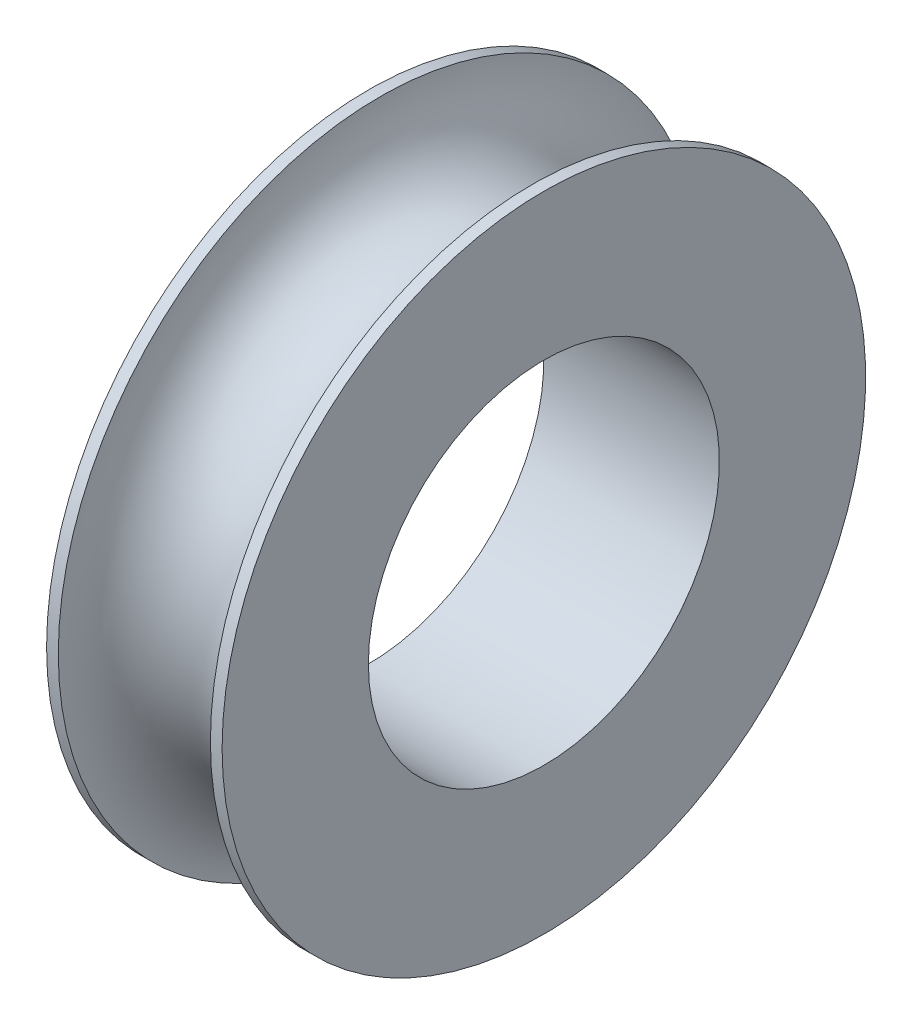
ISO-10303-21;
HEADER;
FILE_DESCRIPTION(('STEP AP214'),'2;1');
FILE_NAME('part.step','',(''),(''),'','','');
FILE_SCHEMA(('AUTOMOTIVE_DESIGN { 1 0 10303 214 1 1 1 1 }'));
ENDSEC;
DATA;
#1=APPLICATION_CONTEXT('core data for automotive mechanical design processes');
#2=APPLICATION_PROTOCOL_DEFINITION('international standard','automotive_design',2000,#1);
#3=PRODUCT_CONTEXT('',#1,'mechanical');
#4=PRODUCT('Part','Part','',(#3));
#5=PRODUCT_RELATED_PRODUCT_CATEGORY('part','',(#4));
#6=PRODUCT_DEFINITION_FORMATION('','',#4);
#7=PRODUCT_DEFINITION_CONTEXT('part definition',#1,'design');
#8=PRODUCT_DEFINITION('design','',#6,#7);
#9=PRODUCT_DEFINITION_SHAPE('','',#8);
#10=(LENGTH_UNIT() NAMED_UNIT(*) SI_UNIT(.MILLI.,.METRE.));
#11=(NAMED_UNIT(*) PLANE_ANGLE_UNIT() SI_UNIT($,.RADIAN.));
#12=(NAMED_UNIT(*) SI_UNIT($,.STERADIAN.) SOLID_ANGLE_UNIT());
#13=UNCERTAINTY_MEASURE_WITH_UNIT(LENGTH_MEASURE(1.E-05),#10,'distance_accuracy_value','');
#14=(GEOMETRIC_REPRESENTATION_CONTEXT(3) GLOBAL_UNCERTAINTY_ASSIGNED_CONTEXT((#13)) GLOBAL_UNIT_ASSIGNED_CONTEXT((#10,
#11,#12)) REPRESENTATION_CONTEXT('',''));
#15=CARTESIAN_POINT('',(0.,0.,0.));
#16=DIRECTION('',(0.,0.,1.));
#17=DIRECTION('',(1.,0.,0.));
#18=AXIS2_PLACEMENT_3D('',#15,#16,#17);
#19=CARTESIAN_POINT('',(-8.53250890397511,0.,0.));
#20=DIRECTION('',(-1.,0.,0.));
#21=DIRECTION('',(0.,0.,1.));
#22=AXIS2_PLACEMENT_3D('',#19,#20,#21);
#23=CYLINDRICAL_SURFACE('',#22,11.);
#24=CARTESIAN_POINT('',(0.,0.,0.));
#25=DIRECTION('',(-1.,0.,0.));
#26=DIRECTION('',(0.,0.,1.));
#27=AXIS2_PLACEMENT_3D('',#24,#25,#26);
#28=CIRCLE('',#27,11.);
#29=CARTESIAN_POINT('',(0.,0.,11.));
#30=VERTEX_POINT('',#29);
#31=EDGE_CURVE('E10',#30,#30,#28,.T.);
#32=ORIENTED_EDGE('',*,*,#31,.F.);
#33=EDGE_LOOP('',(#32));
#34=FACE_BOUND('',#33,.T.);
#35=CARTESIAN_POINT('',(0.400000000000001,0.,0.));
#36=DIRECTION('',(-1.,0.,0.));
#37=DIRECTION('',(0.,0.,1.));
#38=AXIS2_PLACEMENT_3D('',#35,#36,#37);
#39=CIRCLE('',#38,11.);
#40=CARTESIAN_POINT('',(0.400000000000001,0.,11.));
#41=VERTEX_POINT('',#40);
#42=EDGE_CURVE('E58',#41,#41,#39,.T.);
#43=ORIENTED_EDGE('',*,*,#42,.T.);
#44=EDGE_LOOP('',(#43));
#45=FACE_BOUND('',#44,.T.);
#46=ADVANCED_FACE('F36',(#34,#45),#23,.T.);
#47=CARTESIAN_POINT('',(0.,0.,-11.));
#48=DIRECTION('',(1.,0.,0.));
#49=DIRECTION('',(0.,0.,-1.));
#50=AXIS2_PLACEMENT_3D('',#47,#48,#49);
#51=PLANE('',#50);
#52=CARTESIAN_POINT('',(0.,0.,0.));
#53=DIRECTION('',(-1.,0.,0.));
#54=DIRECTION('',(0.,0.,1.));
#55=AXIS2_PLACEMENT_3D('',#52,#53,#54);
#56=CIRCLE('',#55,6.);
#57=CARTESIAN_POINT('',(0.,0.,6.));
#58=VERTEX_POINT('',#57);
#59=EDGE_CURVE('E42',#58,#58,#56,.T.);
#60=ORIENTED_EDGE('',*,*,#59,.F.);
#61=EDGE_LOOP('',(#60));
#62=FACE_BOUND('',#61,.T.);
#63=ORIENTED_EDGE('',*,*,#31,.T.);
#64=EDGE_LOOP('',(#63));
#65=FACE_BOUND('',#64,.T.);
#66=ADVANCED_FACE('F83',(#62,#65),#51,.F.);
#67=CARTESIAN_POINT('',(-8.53250890397511,0.,0.));
#68=DIRECTION('',(-1.,0.,0.));
#69=DIRECTION('',(0.,0.,1.));
#70=AXIS2_PLACEMENT_3D('',#67,#68,#69);
#71=CYLINDRICAL_SURFACE('',#70,6.);
#72=CARTESIAN_POINT('',(6.,0.,0.));
#73=DIRECTION('',(-1.,0.,0.));
#74=DIRECTION('',(0.,0.,1.));
#75=AXIS2_PLACEMENT_3D('',#72,#73,#74);
#76=CIRCLE('',#75,6.);
#77=CARTESIAN_POINT('',(6.,0.,6.));
#78=VERTEX_POINT('',#77);
#79=EDGE_CURVE('E46',#78,#78,#76,.T.);
#80=ORIENTED_EDGE('',*,*,#79,.F.);
#81=EDGE_LOOP('',(#80));
#82=FACE_BOUND('',#81,.T.);
#83=ORIENTED_EDGE('',*,*,#59,.T.);
#84=EDGE_LOOP('',(#83));
#85=FACE_BOUND('',#84,.T.);
#86=ADVANCED_FACE('F78',(#82,#85),#71,.F.);
#87=CARTESIAN_POINT('',(6.,0.,-11.));
#88=DIRECTION('',(-1.,0.,0.));
#89=DIRECTION('',(0.,0.,1.));
#90=AXIS2_PLACEMENT_3D('',#87,#88,#89);
#91=PLANE('',#90);
#92=CARTESIAN_POINT('',(6.,0.,0.));
#93=DIRECTION('',(-1.,0.,0.));
#94=DIRECTION('',(0.,0.,1.));
#95=AXIS2_PLACEMENT_3D('',#92,#93,#94);
#96=CIRCLE('',#95,11.);
#97=CARTESIAN_POINT('',(6.,0.,11.));
#98=VERTEX_POINT('',#97);
#99=EDGE_CURVE('E50',#98,#98,#96,.T.);
#100=ORIENTED_EDGE('',*,*,#99,.F.);
#101=EDGE_LOOP('',(#100));
#102=FACE_BOUND('',#101,.T.);
#103=ORIENTED_EDGE('',*,*,#79,.T.);
#104=EDGE_LOOP('',(#103));
#105=FACE_BOUND('',#104,.T.);
#106=ADVANCED_FACE('F72',(#102,#105),#91,.F.);
#107=CARTESIAN_POINT('',(-8.53250890397511,0.,0.));
#108=DIRECTION('',(-1.,0.,0.));
#109=DIRECTION('',(0.,0.,1.));
#110=AXIS2_PLACEMENT_3D('',#107,#108,#109);
#111=CYLINDRICAL_SURFACE('',#110,11.);
#112=CARTESIAN_POINT('',(5.6,0.,0.));
#113=DIRECTION('',(-1.,0.,0.));
#114=DIRECTION('',(0.,0.,1.));
#115=AXIS2_PLACEMENT_3D('',#112,#113,#114);
#116=CIRCLE('',#115,11.);
#117=CARTESIAN_POINT('',(5.6,0.,11.));
#118=VERTEX_POINT('',#117);
#119=EDGE_CURVE('E55',#118,#118,#116,.T.);
#120=ORIENTED_EDGE('',*,*,#119,.F.);
#121=EDGE_LOOP('',(#120));
#122=FACE_BOUND('',#121,.T.);
#123=ORIENTED_EDGE('',*,*,#99,.T.);
#124=EDGE_LOOP('',(#123));
#125=FACE_BOUND('',#124,.T.);
#126=ADVANCED_FACE('F66',(#122,#125),#111,.T.);
#127=CARTESIAN_POINT('',(3.,0.,0.));
#128=DIRECTION('',(-1.,0.,0.));
#129=DIRECTION('',(0.,0.,1.));
#130=AXIS2_PLACEMENT_3D('',#127,#128,#129);
#131=TOROIDAL_SURFACE('',#130,11.,2.6);
#132=ORIENTED_EDGE('',*,*,#42,.F.);
#133=EDGE_LOOP('',(#132));
#134=FACE_BOUND('',#133,.T.);
#135=ORIENTED_EDGE('',*,*,#119,.T.);
#136=EDGE_LOOP('',(#135));
#137=FACE_BOUND('',#136,.T.);
#138=ADVANCED_FACE('F63',(#134,#137),#131,.F.);
#139=CLOSED_SHELL('',(#46,#66,#86,#106,#126,#138));
#140=MANIFOLD_SOLID_BREP('B2',#139);
#141=ADVANCED_BREP_SHAPE_REPRESENTATION('',(#18,#140),#14);
#142=SHAPE_DEFINITION_REPRESENTATION(#9,#141);
ENDSEC;
END-ISO-10303-21;
